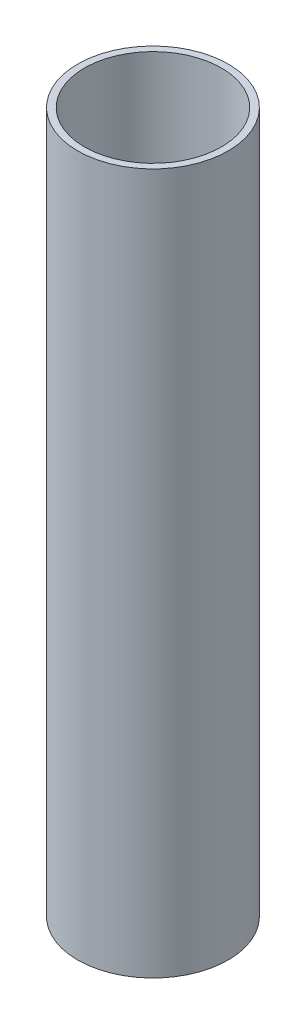
ISO-10303-21;
HEADER;
FILE_DESCRIPTION(('STEP AP214'),'2;1');
FILE_NAME('part.step','',(''),(''),'','','');
FILE_SCHEMA(('AUTOMOTIVE_DESIGN { 1 0 10303 214 1 1 1 1 }'));
ENDSEC;
DATA;
#1=APPLICATION_CONTEXT('core data for automotive mechanical design processes');
#2=APPLICATION_PROTOCOL_DEFINITION('international standard','automotive_design',2000,#1);
#3=PRODUCT_CONTEXT('',#1,'mechanical');
#4=PRODUCT('Part','Part','',(#3));
#5=PRODUCT_RELATED_PRODUCT_CATEGORY('part','',(#4));
#6=PRODUCT_DEFINITION_FORMATION('','',#4);
#7=PRODUCT_DEFINITION_CONTEXT('part definition',#1,'design');
#8=PRODUCT_DEFINITION('design','',#6,#7);
#9=PRODUCT_DEFINITION_SHAPE('','',#8);
#10=(LENGTH_UNIT() NAMED_UNIT(*) SI_UNIT(.MILLI.,.METRE.));
#11=(NAMED_UNIT(*) PLANE_ANGLE_UNIT() SI_UNIT($,.RADIAN.));
#12=(NAMED_UNIT(*) SI_UNIT($,.STERADIAN.) SOLID_ANGLE_UNIT());
#13=UNCERTAINTY_MEASURE_WITH_UNIT(LENGTH_MEASURE(1.E-05),#10,'distance_accuracy_value','');
#14=(GEOMETRIC_REPRESENTATION_CONTEXT(3) GLOBAL_UNCERTAINTY_ASSIGNED_CONTEXT((#13)) GLOBAL_UNIT_ASSIGNED_CONTEXT((#10,
#11,#12)) REPRESENTATION_CONTEXT('',''));
#15=CARTESIAN_POINT('',(0.,0.,0.));
#16=DIRECTION('',(0.,0.,1.));
#17=DIRECTION('',(1.,0.,0.));
#18=AXIS2_PLACEMENT_3D('',#15,#16,#17);
#19=CARTESIAN_POINT('',(0.,390.,0.));
#20=DIRECTION('',(0.,1.,0.));
#21=DIRECTION('',(0.,0.,1.));
#22=AXIS2_PLACEMENT_3D('',#19,#20,#21);
#23=PLANE('',#22);
#24=CARTESIAN_POINT('',(0.,390.,0.));
#25=DIRECTION('',(0.,1.,0.));
#26=DIRECTION('',(0.,0.,1.));
#27=AXIS2_PLACEMENT_3D('',#24,#25,#26);
#28=CIRCLE('',#27,41.9);
#29=CARTESIAN_POINT('',(0.,390.,41.9));
#30=VERTEX_POINT('',#29);
#31=EDGE_CURVE('E10',#30,#30,#28,.T.);
#32=ORIENTED_EDGE('',*,*,#31,.T.);
#33=EDGE_LOOP('',(#32));
#34=FACE_BOUND('',#33,.T.);
#35=CARTESIAN_POINT('',(0.,390.,0.));
#36=DIRECTION('',(0.,1.,0.));
#37=DIRECTION('',(0.,0.,1.));
#38=AXIS2_PLACEMENT_3D('',#35,#36,#37);
#39=CIRCLE('',#38,38.1);
#40=CARTESIAN_POINT('',(0.,390.,38.1));
#41=VERTEX_POINT('',#40);
#42=EDGE_CURVE('E45',#41,#41,#39,.T.);
#43=ORIENTED_EDGE('',*,*,#42,.F.);
#44=EDGE_LOOP('',(#43));
#45=FACE_BOUND('',#44,.T.);
#46=ADVANCED_FACE('F34',(#34,#45),#23,.T.);
#47=CARTESIAN_POINT('',(0.,0.,0.));
#48=DIRECTION('',(0.,1.,0.));
#49=DIRECTION('',(0.,0.,1.));
#50=AXIS2_PLACEMENT_3D('',#47,#48,#49);
#51=PLANE('',#50);
#52=CARTESIAN_POINT('',(0.,0.,0.));
#53=DIRECTION('',(0.,1.,0.));
#54=DIRECTION('',(0.,0.,1.));
#55=AXIS2_PLACEMENT_3D('',#52,#53,#54);
#56=CIRCLE('',#55,41.9);
#57=CARTESIAN_POINT('',(0.,0.,41.9));
#58=VERTEX_POINT('',#57);
#59=EDGE_CURVE('E38',#58,#58,#56,.T.);
#60=ORIENTED_EDGE('',*,*,#59,.F.);
#61=EDGE_LOOP('',(#60));
#62=FACE_BOUND('',#61,.T.);
#63=CARTESIAN_POINT('',(0.,0.,0.));
#64=DIRECTION('',(0.,1.,0.));
#65=DIRECTION('',(0.,0.,1.));
#66=AXIS2_PLACEMENT_3D('',#63,#64,#65);
#67=CIRCLE('',#66,38.1);
#68=CARTESIAN_POINT('',(0.,0.,38.1));
#69=VERTEX_POINT('',#68);
#70=EDGE_CURVE('E47',#69,#69,#67,.T.);
#71=ORIENTED_EDGE('',*,*,#70,.T.);
#72=EDGE_LOOP('',(#71));
#73=FACE_BOUND('',#72,.T.);
#74=ADVANCED_FACE('F57',(#62,#73),#51,.F.);
#75=CARTESIAN_POINT('',(0.,390.,0.));
#76=DIRECTION('',(0.,-1.,0.));
#77=DIRECTION('',(0.,0.,-1.));
#78=AXIS2_PLACEMENT_3D('',#75,#76,#77);
#79=CYLINDRICAL_SURFACE('',#78,41.9);
#80=ORIENTED_EDGE('',*,*,#31,.F.);
#81=EDGE_LOOP('',(#80));
#82=FACE_BOUND('',#81,.T.);
#83=ORIENTED_EDGE('',*,*,#59,.T.);
#84=EDGE_LOOP('',(#83));
#85=FACE_BOUND('',#84,.T.);
#86=ADVANCED_FACE('F36',(#82,#85),#79,.T.);
#87=CARTESIAN_POINT('',(0.,390.,0.));
#88=DIRECTION('',(0.,-1.,0.));
#89=DIRECTION('',(0.,0.,-1.));
#90=AXIS2_PLACEMENT_3D('',#87,#88,#89);
#91=CYLINDRICAL_SURFACE('',#90,38.1);
#92=ORIENTED_EDGE('',*,*,#42,.T.);
#93=EDGE_LOOP('',(#92));
#94=FACE_BOUND('',#93,.T.);
#95=ORIENTED_EDGE('',*,*,#70,.F.);
#96=EDGE_LOOP('',(#95));
#97=FACE_BOUND('',#96,.T.);
#98=ADVANCED_FACE('F53',(#94,#97),#91,.F.);
#99=CLOSED_SHELL('',(#46,#74,#86,#98));
#100=MANIFOLD_SOLID_BREP('B2',#99);
#101=ADVANCED_BREP_SHAPE_REPRESENTATION('',(#18,#100),#14);
#102=SHAPE_DEFINITION_REPRESENTATION(#9,#101);
ENDSEC;
END-ISO-10303-21;
